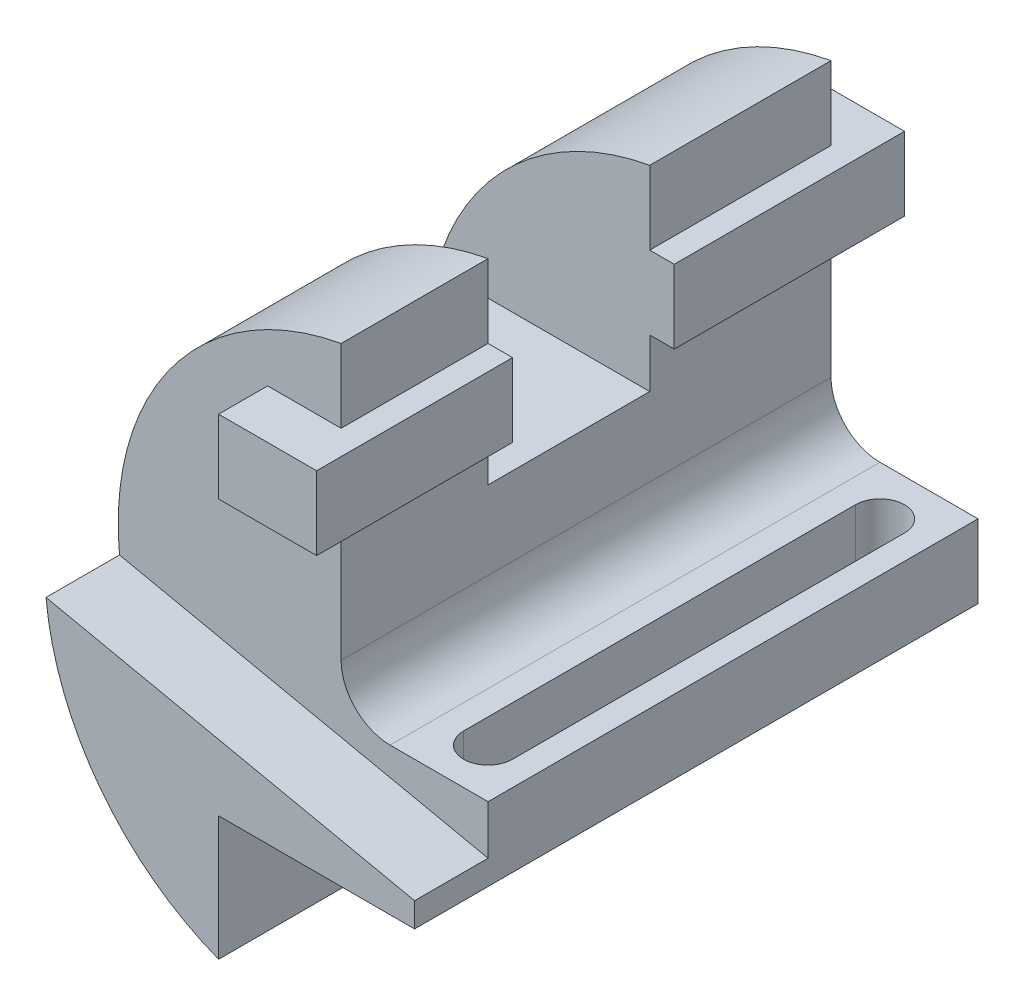
ISO-10303-21;
HEADER;
FILE_DESCRIPTION(('STEP AP214'),'2;1');
FILE_NAME('part.step','',(''),(''),'','','');
FILE_SCHEMA(('AUTOMOTIVE_DESIGN { 1 0 10303 214 1 1 1 1 }'));
ENDSEC;
DATA;
#1=APPLICATION_CONTEXT('core data for automotive mechanical design processes');
#2=APPLICATION_PROTOCOL_DEFINITION('international standard','automotive_design',2000,#1);
#3=PRODUCT_CONTEXT('',#1,'mechanical');
#4=PRODUCT('Part','Part','',(#3));
#5=PRODUCT_RELATED_PRODUCT_CATEGORY('part','',(#4));
#6=PRODUCT_DEFINITION_FORMATION('','',#4);
#7=PRODUCT_DEFINITION_CONTEXT('part definition',#1,'design');
#8=PRODUCT_DEFINITION('design','',#6,#7);
#9=PRODUCT_DEFINITION_SHAPE('','',#8);
#10=(LENGTH_UNIT() NAMED_UNIT(*) SI_UNIT(.MILLI.,.METRE.));
#11=(NAMED_UNIT(*) PLANE_ANGLE_UNIT() SI_UNIT($,.RADIAN.));
#12=(NAMED_UNIT(*) SI_UNIT($,.STERADIAN.) SOLID_ANGLE_UNIT());
#13=UNCERTAINTY_MEASURE_WITH_UNIT(LENGTH_MEASURE(1.E-05),#10,'distance_accuracy_value','');
#14=(GEOMETRIC_REPRESENTATION_CONTEXT(3) GLOBAL_UNCERTAINTY_ASSIGNED_CONTEXT((#13)) GLOBAL_UNIT_ASSIGNED_CONTEXT((#10,
#11,#12)) REPRESENTATION_CONTEXT('',''));
#15=CARTESIAN_POINT('',(0.,0.,0.));
#16=DIRECTION('',(0.,0.,1.));
#17=DIRECTION('',(1.,0.,0.));
#18=AXIS2_PLACEMENT_3D('',#15,#16,#17);
#19=CARTESIAN_POINT('',(0.,0.,100.));
#20=DIRECTION('',(0.,0.,1.));
#21=DIRECTION('',(1.,0.,0.));
#22=AXIS2_PLACEMENT_3D('',#19,#20,#21);
#23=PLANE('',#22);
#24=CARTESIAN_POINT('',(0.,0.,100.));
#25=DIRECTION('',(0.,0.,1.));
#26=DIRECTION('',(1.,0.,0.));
#27=AXIS2_PLACEMENT_3D('',#24,#25,#26);
#28=CIRCLE('',#27,55.5);
#29=CARTESIAN_POINT('',(-10.,54.5916660306315,100.));
#30=VERTEX_POINT('',#29);
#31=CARTESIAN_POINT('',(-55.2350441418964,-5.41663166947499,100.));
#32=VERTEX_POINT('',#31);
#33=EDGE_CURVE('E57',#30,#32,#28,.T.);
#34=ORIENTED_EDGE('',*,*,#33,.T.);
#35=DIRECTION('',(-0.978147600733806,0.207911690817756,0.));
#36=VECTOR('',#35,1.);
#37=CARTESIAN_POINT('',(20.,-21.4083339693686,100.));
#38=LINE('',#37,#36);
#39=CARTESIAN_POINT('',(20.,-21.4083339693686,100.));
#40=VERTEX_POINT('',#39);
#41=EDGE_CURVE('E52',#40,#32,#38,.T.);
#42=ORIENTED_EDGE('',*,*,#41,.F.);
#43=DIRECTION('',(0.,1.,0.));
#44=VECTOR('',#43,1.);
#45=CARTESIAN_POINT('',(20.,-11.4083339693686,100.));
#46=LINE('',#45,#44);
#47=CARTESIAN_POINT('',(20.,-11.4083339693686,100.));
#48=VERTEX_POINT('',#47);
#49=EDGE_CURVE('E244',#40,#48,#46,.T.);
#50=ORIENTED_EDGE('',*,*,#49,.T.);
#51=DIRECTION('',(-1.,0.,0.));
#52=VECTOR('',#51,1.);
#53=CARTESIAN_POINT('',(0.,-11.4083339693686,100.));
#54=LINE('',#53,#52);
#55=CARTESIAN_POINT('',(0.,-11.4083339693686,100.));
#56=VERTEX_POINT('',#55);
#57=EDGE_CURVE('E400',#48,#56,#54,.T.);
#58=ORIENTED_EDGE('',*,*,#57,.T.);
#59=CARTESIAN_POINT('',(0.,-1.40833396936856,100.));
#60=DIRECTION('',(0.,0.,-1.));
#61=DIRECTION('',(-1.,0.,0.));
#62=AXIS2_PLACEMENT_3D('',#59,#60,#61);
#63=CIRCLE('',#62,10.);
#64=CARTESIAN_POINT('',(-10.,-1.40833396936856,100.));
#65=VERTEX_POINT('',#64);
#66=EDGE_CURVE('E402',#56,#65,#63,.T.);
#67=ORIENTED_EDGE('',*,*,#66,.T.);
#68=DIRECTION('',(0.,1.,0.));
#69=VECTOR('',#68,1.);
#70=CARTESIAN_POINT('',(-10.,54.5916660306315,100.));
#71=LINE('',#70,#69);
#72=CARTESIAN_POINT('',(-10.,24.5916660306315,100.));
#73=VERTEX_POINT('',#72);
#74=EDGE_CURVE('E405',#65,#73,#71,.T.);
#75=ORIENTED_EDGE('',*,*,#74,.T.);
#76=DIRECTION('',(1.,0.,0.));
#77=VECTOR('',#76,1.);
#78=CARTESIAN_POINT('',(0.,24.5916660306315,100.));
#79=LINE('',#78,#77);
#80=CARTESIAN_POINT('',(-25.,24.5916660306315,100.));
#81=VERTEX_POINT('',#80);
#82=EDGE_CURVE('E304',#81,#73,#79,.T.);
#83=ORIENTED_EDGE('',*,*,#82,.F.);
#84=DIRECTION('',(0.,-1.,0.));
#85=VECTOR('',#84,1.);
#86=CARTESIAN_POINT('',(-25.,0.,100.));
#87=LINE('',#86,#85);
#88=CARTESIAN_POINT('',(-25.,39.5916660306315,100.));
#89=VERTEX_POINT('',#88);
#90=EDGE_CURVE('E317',#89,#81,#87,.T.);
#91=ORIENTED_EDGE('',*,*,#90,.F.);
#92=DIRECTION('',(-1.,0.,0.));
#93=VECTOR('',#92,1.);
#94=CARTESIAN_POINT('',(0.,39.5916660306315,100.));
#95=LINE('',#94,#93);
#96=CARTESIAN_POINT('',(-10.,39.5916660306315,100.));
#97=VERTEX_POINT('',#96);
#98=EDGE_CURVE('E320',#97,#89,#95,.T.);
#99=ORIENTED_EDGE('',*,*,#98,.F.);
#100=EDGE_CURVE('E404',#97,#30,#71,.T.);
#101=ORIENTED_EDGE('',*,*,#100,.T.);
#102=EDGE_LOOP('',(#34,#42,#50,#58,#67,#75,#83,#91,#99,#101));
#103=FACE_BOUND('',#102,.T.);
#104=ADVANCED_FACE('F37',(#103),#23,.T.);
#105=CARTESIAN_POINT('',(-10.,54.5916660306315,100.));
#106=DIRECTION('',(-1.,0.,0.));
#107=DIRECTION('',(0.,-1.,0.));
#108=AXIS2_PLACEMENT_3D('',#105,#106,#107);
#109=PLANE('',#108);
#110=ORIENTED_EDGE('',*,*,#100,.F.);
#111=DIRECTION('',(0.,0.,-1.));
#112=VECTOR('',#111,1.);
#113=CARTESIAN_POINT('',(-10.,39.5916660306315,100.));
#114=LINE('',#113,#112);
#115=CARTESIAN_POINT('',(-10.,39.5916660306315,70.));
#116=VERTEX_POINT('',#115);
#117=EDGE_CURVE('E323',#97,#116,#114,.T.);
#118=ORIENTED_EDGE('',*,*,#117,.T.);
#119=DIRECTION('',(0.,-1.,0.));
#120=VECTOR('',#119,1.);
#121=CARTESIAN_POINT('',(-10.,54.5916660306315,70.));
#122=LINE('',#121,#120);
#123=CARTESIAN_POINT('',(-10.,54.5916660306315,70.));
#124=VERTEX_POINT('',#123);
#125=EDGE_CURVE('E372',#124,#116,#122,.T.);
#126=ORIENTED_EDGE('',*,*,#125,.F.);
#127=DIRECTION('',(0.,0.,-1.));
#128=VECTOR('',#127,1.);
#129=CARTESIAN_POINT('',(-10.,54.5916660306315,100.));
#130=LINE('',#129,#128);
#131=EDGE_CURVE('E423',#30,#124,#130,.T.);
#132=ORIENTED_EDGE('',*,*,#131,.F.);
#133=EDGE_LOOP('',(#110,#118,#126,#132));
#134=FACE_BOUND('',#133,.T.);
#135=ADVANCED_FACE('F477',(#134),#109,.F.);
#136=DIRECTION('',(0.,1.,0.));
#137=VECTOR('',#136,1.);
#138=CARTESIAN_POINT('',(-10.,54.5916660306315,37.));
#139=LINE('',#138,#137);
#140=CARTESIAN_POINT('',(-10.,39.5916660306315,37.));
#141=VERTEX_POINT('',#140);
#142=CARTESIAN_POINT('',(-10.,54.5916660306315,37.));
#143=VERTEX_POINT('',#142);
#144=EDGE_CURVE('E378',#141,#143,#139,.T.);
#145=ORIENTED_EDGE('',*,*,#144,.F.);
#146=DIRECTION('',(0.,0.,-1.));
#147=VECTOR('',#146,1.);
#148=CARTESIAN_POINT('',(-10.,39.5916660306315,100.));
#149=LINE('',#148,#147);
#150=CARTESIAN_POINT('',(-10.,39.5916660306315,0.));
#151=VERTEX_POINT('',#150);
#152=EDGE_CURVE('E365',#141,#151,#149,.T.);
#153=ORIENTED_EDGE('',*,*,#152,.T.);
#154=DIRECTION('',(0.,1.,0.));
#155=VECTOR('',#154,1.);
#156=CARTESIAN_POINT('',(-10.,54.5916660306315,0.));
#157=LINE('',#156,#155);
#158=CARTESIAN_POINT('',(-10.,54.5916660306315,0.));
#159=VERTEX_POINT('',#158);
#160=EDGE_CURVE('E420',#151,#159,#157,.T.);
#161=ORIENTED_EDGE('',*,*,#160,.T.);
#162=EDGE_CURVE('E407',#143,#159,#130,.T.);
#163=ORIENTED_EDGE('',*,*,#162,.F.);
#164=EDGE_LOOP('',(#145,#153,#161,#163));
#165=FACE_BOUND('',#164,.T.);
#166=ADVANCED_FACE('F489',(#165),#109,.F.);
#167=CARTESIAN_POINT('',(0.,0.,100.));
#168=DIRECTION('',(0.,0.,-1.));
#169=DIRECTION('',(-1.,0.,0.));
#170=AXIS2_PLACEMENT_3D('',#167,#168,#169);
#171=CYLINDRICAL_SURFACE('',#170,55.5);
#172=ORIENTED_EDGE('',*,*,#131,.T.);
#173=CARTESIAN_POINT('',(0.,0.,70.));
#174=DIRECTION('',(0.,0.,1.));
#175=DIRECTION('',(1.,0.,0.));
#176=AXIS2_PLACEMENT_3D('',#173,#174,#175);
#177=CIRCLE('',#176,55.5);
#178=CARTESIAN_POINT('',(-53.5474862383895,14.5916660306314,70.));
#179=VERTEX_POINT('',#178);
#180=EDGE_CURVE('E393',#124,#179,#177,.T.);
#181=ORIENTED_EDGE('',*,*,#180,.T.);
#182=DIRECTION('',(0.,0.,-1.));
#183=VECTOR('',#182,1.);
#184=CARTESIAN_POINT('',(-53.5474862383895,14.5916660306314,100.));
#185=LINE('',#184,#183);
#186=CARTESIAN_POINT('',(-53.5474862383895,14.5916660306314,37.));
#187=VERTEX_POINT('',#186);
#188=EDGE_CURVE('E385',#179,#187,#185,.T.);
#189=ORIENTED_EDGE('',*,*,#188,.T.);
#190=CARTESIAN_POINT('',(0.,0.,37.));
#191=DIRECTION('',(0.,0.,-1.));
#192=DIRECTION('',(0.,1.,0.));
#193=AXIS2_PLACEMENT_3D('',#190,#191,#192);
#194=CIRCLE('',#193,55.5);
#195=EDGE_CURVE('E390',#187,#143,#194,.T.);
#196=ORIENTED_EDGE('',*,*,#195,.T.);
#197=ORIENTED_EDGE('',*,*,#162,.T.);
#198=CARTESIAN_POINT('',(0.,0.,0.));
#199=DIRECTION('',(0.,0.,1.));
#200=DIRECTION('',(1.,0.,0.));
#201=AXIS2_PLACEMENT_3D('',#198,#199,#200);
#202=CIRCLE('',#201,55.5);
#203=CARTESIAN_POINT('',(-20.,-51.7711309515255,0.));
#204=VERTEX_POINT('',#203);
#205=EDGE_CURVE('E396',#159,#204,#202,.T.);
#206=ORIENTED_EDGE('',*,*,#205,.T.);
#207=DIRECTION('',(0.,0.,-1.));
#208=VECTOR('',#207,1.);
#209=CARTESIAN_POINT('',(-20.,-51.7711309515255,100.));
#210=LINE('',#209,#208);
#211=CARTESIAN_POINT('',(-20.,-51.7711309515255,115.));
#212=VERTEX_POINT('',#211);
#213=EDGE_CURVE('E11',#212,#204,#210,.T.);
#214=ORIENTED_EDGE('',*,*,#213,.F.);
#215=CARTESIAN_POINT('',(0.,0.,115.));
#216=DIRECTION('',(0.,0.,1.));
#217=DIRECTION('',(1.,0.,0.));
#218=AXIS2_PLACEMENT_3D('',#215,#216,#217);
#219=CIRCLE('',#218,55.5);
#220=CARTESIAN_POINT('',(-55.2350441418964,-5.41663166947499,115.));
#221=VERTEX_POINT('',#220);
#222=EDGE_CURVE('E230',#221,#212,#219,.T.);
#223=ORIENTED_EDGE('',*,*,#222,.F.);
#224=DIRECTION('',(0.,0.,-1.));
#225=VECTOR('',#224,1.);
#226=CARTESIAN_POINT('',(-55.2350441418964,-5.41663166947499,115.));
#227=LINE('',#226,#225);
#228=EDGE_CURVE('E226',#221,#32,#227,.T.);
#229=ORIENTED_EDGE('',*,*,#228,.T.);
#230=ORIENTED_EDGE('',*,*,#33,.F.);
#231=EDGE_LOOP('',(#172,#181,#189,#196,#197,#206,#214,#223,#229,#230));
#232=FACE_BOUND('',#231,.T.);
#233=ADVANCED_FACE('F39',(#232),#171,.T.);
#234=CARTESIAN_POINT('',(-20.,-26.4083339693686,100.));
#235=DIRECTION('',(-1.,0.,0.));
#236=DIRECTION('',(0.,-1.,0.));
#237=AXIS2_PLACEMENT_3D('',#234,#235,#236);
#238=PLANE('',#237);
#239=DIRECTION('',(0.,1.,0.));
#240=VECTOR('',#239,1.);
#241=CARTESIAN_POINT('',(-20.,-26.4083339693686,0.));
#242=LINE('',#241,#240);
#243=CARTESIAN_POINT('',(-20.,-26.4083339693686,0.));
#244=VERTEX_POINT('',#243);
#245=EDGE_CURVE('E410',#204,#244,#242,.T.);
#246=ORIENTED_EDGE('',*,*,#245,.T.);
#247=DIRECTION('',(0.,0.,-1.));
#248=VECTOR('',#247,1.);
#249=CARTESIAN_POINT('',(-20.,-26.4083339693686,100.));
#250=LINE('',#249,#248);
#251=CARTESIAN_POINT('',(-20.,-26.4083339693686,115.));
#252=VERTEX_POINT('',#251);
#253=EDGE_CURVE('E45',#252,#244,#250,.T.);
#254=ORIENTED_EDGE('',*,*,#253,.F.);
#255=DIRECTION('',(0.,1.,0.));
#256=VECTOR('',#255,1.);
#257=CARTESIAN_POINT('',(-20.,-51.7711309515255,115.));
#258=LINE('',#257,#256);
#259=EDGE_CURVE('E480',#212,#252,#258,.T.);
#260=ORIENTED_EDGE('',*,*,#259,.F.);
#261=ORIENTED_EDGE('',*,*,#213,.T.);
#262=EDGE_LOOP('',(#246,#254,#260,#261));
#263=FACE_BOUND('',#262,.T.);
#264=ADVANCED_FACE('F484',(#263),#238,.F.);
#265=CARTESIAN_POINT('',(20.,-26.4083339693686,100.));
#266=DIRECTION('',(0.,1.,0.));
#267=DIRECTION('',(-1.,0.,0.));
#268=AXIS2_PLACEMENT_3D('',#265,#266,#267);
#269=PLANE('',#268);
#270=DIRECTION('',(0.,0.,1.));
#271=VECTOR('',#270,1.);
#272=CARTESIAN_POINT('',(15.,-26.4083339693686,10.));
#273=LINE('',#272,#271);
#274=CARTESIAN_POINT('',(15.,-26.4083339693686,10.));
#275=VERTEX_POINT('',#274);
#276=CARTESIAN_POINT('',(15.,-26.4083339693686,90.));
#277=VERTEX_POINT('',#276);
#278=EDGE_CURVE('E247',#275,#277,#273,.T.);
#279=ORIENTED_EDGE('',*,*,#278,.F.);
#280=CARTESIAN_POINT('',(10.,-26.4083339693686,10.));
#281=DIRECTION('',(0.,1.,0.));
#282=DIRECTION('',(-1.,0.,0.));
#283=AXIS2_PLACEMENT_3D('',#280,#281,#282);
#284=CIRCLE('',#283,5.);
#285=CARTESIAN_POINT('',(5.,-26.4083339693686,10.));
#286=VERTEX_POINT('',#285);
#287=EDGE_CURVE('E254',#286,#275,#284,.F.);
#288=ORIENTED_EDGE('',*,*,#287,.F.);
#289=DIRECTION('',(0.,0.,-1.));
#290=VECTOR('',#289,1.);
#291=CARTESIAN_POINT('',(5.,-26.4083339693686,10.));
#292=LINE('',#291,#290);
#293=CARTESIAN_POINT('',(5.00000000000001,-26.4083339693686,90.));
#294=VERTEX_POINT('',#293);
#295=EDGE_CURVE('E271',#294,#286,#292,.T.);
#296=ORIENTED_EDGE('',*,*,#295,.F.);
#297=CARTESIAN_POINT('',(10.,-26.4083339693686,90.));
#298=DIRECTION('',(0.,1.,0.));
#299=DIRECTION('',(-1.,0.,0.));
#300=AXIS2_PLACEMENT_3D('',#297,#298,#299);
#301=CIRCLE('',#300,5.);
#302=EDGE_CURVE('E245',#277,#294,#301,.F.);
#303=ORIENTED_EDGE('',*,*,#302,.F.);
#304=EDGE_LOOP('',(#279,#288,#296,#303));
#305=FACE_BOUND('',#304,.T.);
#306=DIRECTION('',(1.,0.,0.));
#307=VECTOR('',#306,1.);
#308=CARTESIAN_POINT('',(20.,-26.4083339693686,0.));
#309=LINE('',#308,#307);
#310=CARTESIAN_POINT('',(20.,-26.4083339693686,0.));
#311=VERTEX_POINT('',#310);
#312=EDGE_CURVE('E412',#244,#311,#309,.T.);
#313=ORIENTED_EDGE('',*,*,#312,.T.);
#314=DIRECTION('',(0.,0.,-1.));
#315=VECTOR('',#314,1.);
#316=CARTESIAN_POINT('',(20.,-26.4083339693686,100.));
#317=LINE('',#316,#315);
#318=CARTESIAN_POINT('',(20.,-26.4083339693686,115.));
#319=VERTEX_POINT('',#318);
#320=EDGE_CURVE('E435',#319,#311,#317,.T.);
#321=ORIENTED_EDGE('',*,*,#320,.F.);
#322=DIRECTION('',(1.,0.,0.));
#323=VECTOR('',#322,1.);
#324=CARTESIAN_POINT('',(-20.,-26.4083339693686,115.));
#325=LINE('',#324,#323);
#326=EDGE_CURVE('E238',#252,#319,#325,.T.);
#327=ORIENTED_EDGE('',*,*,#326,.F.);
#328=ORIENTED_EDGE('',*,*,#253,.T.);
#329=EDGE_LOOP('',(#313,#321,#327,#328));
#330=FACE_BOUND('',#329,.T.);
#331=ADVANCED_FACE('F439',(#305,#330),#269,.F.);
#332=CARTESIAN_POINT('',(20.,-11.4083339693686,100.));
#333=DIRECTION('',(-1.,0.,0.));
#334=DIRECTION('',(0.,0.,1.));
#335=AXIS2_PLACEMENT_3D('',#332,#333,#334);
#336=PLANE('',#335);
#337=DIRECTION('',(0.,1.,0.));
#338=VECTOR('',#337,1.);
#339=CARTESIAN_POINT('',(20.,-11.4083339693686,0.));
#340=LINE('',#339,#338);
#341=CARTESIAN_POINT('',(20.,-11.4083339693686,0.));
#342=VERTEX_POINT('',#341);
#343=EDGE_CURVE('E414',#311,#342,#340,.T.);
#344=ORIENTED_EDGE('',*,*,#343,.T.);
#345=DIRECTION('',(0.,0.,-1.));
#346=VECTOR('',#345,1.);
#347=CARTESIAN_POINT('',(20.,-11.4083339693686,100.));
#348=LINE('',#347,#346);
#349=EDGE_CURVE('E432',#48,#342,#348,.T.);
#350=ORIENTED_EDGE('',*,*,#349,.F.);
#351=ORIENTED_EDGE('',*,*,#49,.F.);
#352=DIRECTION('',(0.,0.,-1.));
#353=VECTOR('',#352,1.);
#354=CARTESIAN_POINT('',(20.,-21.4083339693686,115.));
#355=LINE('',#354,#353);
#356=CARTESIAN_POINT('',(20.,-21.4083339693686,115.));
#357=VERTEX_POINT('',#356);
#358=EDGE_CURVE('E224',#357,#40,#355,.T.);
#359=ORIENTED_EDGE('',*,*,#358,.F.);
#360=DIRECTION('',(0.,1.,0.));
#361=VECTOR('',#360,1.);
#362=CARTESIAN_POINT('',(20.,-21.4083339693686,115.));
#363=LINE('',#362,#361);
#364=EDGE_CURVE('E231',#319,#357,#363,.T.);
#365=ORIENTED_EDGE('',*,*,#364,.F.);
#366=ORIENTED_EDGE('',*,*,#320,.T.);
#367=EDGE_LOOP('',(#344,#350,#351,#359,#365,#366));
#368=FACE_BOUND('',#367,.T.);
#369=ADVANCED_FACE('F242',(#368),#336,.F.);
#370=CARTESIAN_POINT('',(0.,-11.4083339693686,100.));
#371=DIRECTION('',(0.,-1.,0.));
#372=DIRECTION('',(1.,0.,0.));
#373=AXIS2_PLACEMENT_3D('',#370,#371,#372);
#374=PLANE('',#373);
#375=DIRECTION('',(0.,0.,1.));
#376=VECTOR('',#375,1.);
#377=CARTESIAN_POINT('',(5.00000000000001,-11.4083339693686,10.));
#378=LINE('',#377,#376);
#379=CARTESIAN_POINT('',(5.00000000000001,-11.4083339693686,10.));
#380=VERTEX_POINT('',#379);
#381=CARTESIAN_POINT('',(5.00000000000001,-11.4083339693686,90.));
#382=VERTEX_POINT('',#381);
#383=EDGE_CURVE('E259',#380,#382,#378,.T.);
#384=ORIENTED_EDGE('',*,*,#383,.F.);
#385=CARTESIAN_POINT('',(10.,-11.4083339693686,10.));
#386=DIRECTION('',(0.,1.,0.));
#387=DIRECTION('',(-1.,0.,0.));
#388=AXIS2_PLACEMENT_3D('',#385,#386,#387);
#389=CIRCLE('',#388,5.);
#390=CARTESIAN_POINT('',(15.,-11.4083339693686,10.));
#391=VERTEX_POINT('',#390);
#392=EDGE_CURVE('E257',#391,#380,#389,.T.);
#393=ORIENTED_EDGE('',*,*,#392,.F.);
#394=DIRECTION('',(0.,0.,-1.));
#395=VECTOR('',#394,1.);
#396=CARTESIAN_POINT('',(15.,-11.4083339693686,10.));
#397=LINE('',#396,#395);
#398=CARTESIAN_POINT('',(15.,-11.4083339693686,90.));
#399=VERTEX_POINT('',#398);
#400=EDGE_CURVE('E265',#399,#391,#397,.T.);
#401=ORIENTED_EDGE('',*,*,#400,.F.);
#402=CARTESIAN_POINT('',(10.,-11.4083339693686,90.));
#403=DIRECTION('',(0.,1.,0.));
#404=DIRECTION('',(-1.,0.,0.));
#405=AXIS2_PLACEMENT_3D('',#402,#403,#404);
#406=CIRCLE('',#405,5.);
#407=EDGE_CURVE('E262',#382,#399,#406,.T.);
#408=ORIENTED_EDGE('',*,*,#407,.F.);
#409=EDGE_LOOP('',(#384,#393,#401,#408));
#410=FACE_BOUND('',#409,.T.);
#411=DIRECTION('',(-1.,0.,0.));
#412=VECTOR('',#411,1.);
#413=CARTESIAN_POINT('',(0.,-11.4083339693686,0.));
#414=LINE('',#413,#412);
#415=CARTESIAN_POINT('',(0.,-11.4083339693686,0.));
#416=VERTEX_POINT('',#415);
#417=EDGE_CURVE('E416',#342,#416,#414,.T.);
#418=ORIENTED_EDGE('',*,*,#417,.T.);
#419=DIRECTION('',(0.,0.,-1.));
#420=VECTOR('',#419,1.);
#421=CARTESIAN_POINT('',(0.,-11.4083339693686,100.));
#422=LINE('',#421,#420);
#423=EDGE_CURVE('E429',#56,#416,#422,.T.);
#424=ORIENTED_EDGE('',*,*,#423,.F.);
#425=ORIENTED_EDGE('',*,*,#57,.F.);
#426=ORIENTED_EDGE('',*,*,#349,.T.);
#427=EDGE_LOOP('',(#418,#424,#425,#426));
#428=FACE_BOUND('',#427,.T.);
#429=ADVANCED_FACE('F451',(#410,#428),#374,.F.);
#430=CARTESIAN_POINT('',(0.,-1.40833396936856,100.));
#431=DIRECTION('',(0.,0.,-1.));
#432=DIRECTION('',(-1.,0.,0.));
#433=AXIS2_PLACEMENT_3D('',#430,#431,#432);
#434=CYLINDRICAL_SURFACE('',#433,10.);
#435=CARTESIAN_POINT('',(0.,-1.40833396936856,0.));
#436=DIRECTION('',(0.,0.,-1.));
#437=DIRECTION('',(-1.,0.,0.));
#438=AXIS2_PLACEMENT_3D('',#435,#436,#437);
#439=CIRCLE('',#438,10.);
#440=CARTESIAN_POINT('',(-10.,-1.40833396936856,0.));
#441=VERTEX_POINT('',#440);
#442=EDGE_CURVE('E418',#416,#441,#439,.T.);
#443=ORIENTED_EDGE('',*,*,#442,.T.);
#444=DIRECTION('',(0.,0.,-1.));
#445=VECTOR('',#444,1.);
#446=CARTESIAN_POINT('',(-10.,-1.40833396936856,100.));
#447=LINE('',#446,#445);
#448=EDGE_CURVE('E426',#65,#441,#447,.T.);
#449=ORIENTED_EDGE('',*,*,#448,.F.);
#450=ORIENTED_EDGE('',*,*,#66,.F.);
#451=ORIENTED_EDGE('',*,*,#423,.T.);
#452=EDGE_LOOP('',(#443,#449,#450,#451));
#453=FACE_BOUND('',#452,.T.);
#454=ADVANCED_FACE('F457',(#453),#434,.F.);
#455=CARTESIAN_POINT('',(-10.,24.5916660306315,70.));
#456=VERTEX_POINT('',#455);
#457=CARTESIAN_POINT('',(-10.,14.5916660306315,70.));
#458=VERTEX_POINT('',#457);
#459=EDGE_CURVE('E371',#456,#458,#122,.T.);
#460=ORIENTED_EDGE('',*,*,#459,.F.);
#461=DIRECTION('',(0.,0.,1.));
#462=VECTOR('',#461,1.);
#463=CARTESIAN_POINT('',(-10.,24.5916660306315,100.));
#464=LINE('',#463,#462);
#465=EDGE_CURVE('E314',#456,#73,#464,.T.);
#466=ORIENTED_EDGE('',*,*,#465,.T.);
#467=ORIENTED_EDGE('',*,*,#74,.F.);
#468=ORIENTED_EDGE('',*,*,#448,.T.);
#469=CARTESIAN_POINT('',(-10.,24.5916660306315,0.));
#470=VERTEX_POINT('',#469);
#471=EDGE_CURVE('E398',#441,#470,#157,.T.);
#472=ORIENTED_EDGE('',*,*,#471,.T.);
#473=DIRECTION('',(0.,0.,1.));
#474=VECTOR('',#473,1.);
#475=CARTESIAN_POINT('',(-10.,24.5916660306315,100.));
#476=LINE('',#475,#474);
#477=CARTESIAN_POINT('',(-10.,24.5916660306315,37.));
#478=VERTEX_POINT('',#477);
#479=EDGE_CURVE('E359',#470,#478,#476,.T.);
#480=ORIENTED_EDGE('',*,*,#479,.T.);
#481=CARTESIAN_POINT('',(-10.,14.5916660306314,37.));
#482=VERTEX_POINT('',#481);
#483=EDGE_CURVE('E379',#482,#478,#139,.T.);
#484=ORIENTED_EDGE('',*,*,#483,.F.);
#485=DIRECTION('',(0.,0.,-1.));
#486=VECTOR('',#485,1.);
#487=CARTESIAN_POINT('',(-10.,14.5916660306314,70.));
#488=LINE('',#487,#486);
#489=EDGE_CURVE('E375',#458,#482,#488,.T.);
#490=ORIENTED_EDGE('',*,*,#489,.F.);
#491=EDGE_LOOP('',(#460,#466,#467,#468,#472,#480,#484,#490));
#492=FACE_BOUND('',#491,.T.);
#493=ADVANCED_FACE('F460',(#492),#109,.F.);
#494=CARTESIAN_POINT('',(0.,0.,0.));
#495=DIRECTION('',(0.,0.,1.));
#496=DIRECTION('',(1.,0.,0.));
#497=AXIS2_PLACEMENT_3D('',#494,#495,#496);
#498=PLANE('',#497);
#499=ORIENTED_EDGE('',*,*,#160,.F.);
#500=DIRECTION('',(-1.,0.,0.));
#501=VECTOR('',#500,1.);
#502=CARTESIAN_POINT('',(0.,39.5916660306315,0.));
#503=LINE('',#502,#501);
#504=CARTESIAN_POINT('',(-25.,39.5916660306315,0.));
#505=VERTEX_POINT('',#504);
#506=EDGE_CURVE('E362',#151,#505,#503,.T.);
#507=ORIENTED_EDGE('',*,*,#506,.T.);
#508=DIRECTION('',(0.,-1.,0.));
#509=VECTOR('',#508,1.);
#510=CARTESIAN_POINT('',(-25.,0.,0.));
#511=LINE('',#510,#509);
#512=CARTESIAN_POINT('',(-25.,24.5916660306315,0.));
#513=VERTEX_POINT('',#512);
#514=EDGE_CURVE('E368',#505,#513,#511,.T.);
#515=ORIENTED_EDGE('',*,*,#514,.T.);
#516=DIRECTION('',(1.,0.,0.));
#517=VECTOR('',#516,1.);
#518=CARTESIAN_POINT('',(0.,24.5916660306315,0.));
#519=LINE('',#518,#517);
#520=EDGE_CURVE('E349',#513,#470,#519,.T.);
#521=ORIENTED_EDGE('',*,*,#520,.T.);
#522=ORIENTED_EDGE('',*,*,#471,.F.);
#523=ORIENTED_EDGE('',*,*,#442,.F.);
#524=ORIENTED_EDGE('',*,*,#417,.F.);
#525=ORIENTED_EDGE('',*,*,#343,.F.);
#526=ORIENTED_EDGE('',*,*,#312,.F.);
#527=ORIENTED_EDGE('',*,*,#245,.F.);
#528=ORIENTED_EDGE('',*,*,#205,.F.);
#529=EDGE_LOOP('',(#499,#507,#515,#521,#522,#523,#524,#525,#526,#527,#528));
#530=FACE_BOUND('',#529,.T.);
#531=ADVANCED_FACE('F445',(#530),#498,.F.);
#532=CARTESIAN_POINT('',(-55.5,54.5916660306314,70.));
#533=DIRECTION('',(0.,0.,1.));
#534=DIRECTION('',(1.,0.,0.));
#535=AXIS2_PLACEMENT_3D('',#532,#533,#534);
#536=PLANE('',#535);
#537=ORIENTED_EDGE('',*,*,#125,.T.);
#538=DIRECTION('',(1.,0.,0.));
#539=VECTOR('',#538,1.);
#540=CARTESIAN_POINT('',(-5.,39.5916660306315,70.));
#541=LINE('',#540,#539);
#542=CARTESIAN_POINT('',(-5.,39.5916660306315,70.));
#543=VERTEX_POINT('',#542);
#544=EDGE_CURVE('E285',#116,#543,#541,.T.);
#545=ORIENTED_EDGE('',*,*,#544,.T.);
#546=DIRECTION('',(0.,-1.,0.));
#547=VECTOR('',#546,1.);
#548=CARTESIAN_POINT('',(-5.,39.5916660306315,70.));
#549=LINE('',#548,#547);
#550=CARTESIAN_POINT('',(-5.,24.5916660306315,70.));
#551=VERTEX_POINT('',#550);
#552=EDGE_CURVE('E280',#543,#551,#549,.T.);
#553=ORIENTED_EDGE('',*,*,#552,.T.);
#554=DIRECTION('',(-1.,0.,0.));
#555=VECTOR('',#554,1.);
#556=CARTESIAN_POINT('',(-5.,24.5916660306315,70.));
#557=LINE('',#556,#555);
#558=EDGE_CURVE('E297',#551,#456,#557,.T.);
#559=ORIENTED_EDGE('',*,*,#558,.T.);
#560=ORIENTED_EDGE('',*,*,#459,.T.);
#561=DIRECTION('',(1.,0.,0.));
#562=VECTOR('',#561,1.);
#563=CARTESIAN_POINT('',(-55.5,14.5916660306314,70.));
#564=LINE('',#563,#562);
#565=EDGE_CURVE('E382',#179,#458,#564,.T.);
#566=ORIENTED_EDGE('',*,*,#565,.F.);
#567=ORIENTED_EDGE('',*,*,#180,.F.);
#568=EDGE_LOOP('',(#537,#545,#553,#559,#560,#566,#567));
#569=FACE_BOUND('',#568,.T.);
#570=ADVANCED_FACE('F513',(#569),#536,.F.);
#571=CARTESIAN_POINT('',(-55.5,54.5916660306314,37.));
#572=DIRECTION('',(0.,0.,-1.));
#573=DIRECTION('',(0.,1.,0.));
#574=AXIS2_PLACEMENT_3D('',#571,#572,#573);
#575=PLANE('',#574);
#576=ORIENTED_EDGE('',*,*,#483,.T.);
#577=DIRECTION('',(1.,0.,0.));
#578=VECTOR('',#577,1.);
#579=CARTESIAN_POINT('',(-25.,24.5916660306315,37.));
#580=LINE('',#579,#578);
#581=CARTESIAN_POINT('',(-5.,24.5916660306315,37.));
#582=VERTEX_POINT('',#581);
#583=EDGE_CURVE('E325',#478,#582,#580,.T.);
#584=ORIENTED_EDGE('',*,*,#583,.T.);
#585=DIRECTION('',(0.,1.,0.));
#586=VECTOR('',#585,1.);
#587=CARTESIAN_POINT('',(-5.,39.5916660306315,37.));
#588=LINE('',#587,#586);
#589=CARTESIAN_POINT('',(-5.,39.5916660306315,37.));
#590=VERTEX_POINT('',#589);
#591=EDGE_CURVE('E341',#582,#590,#588,.T.);
#592=ORIENTED_EDGE('',*,*,#591,.T.);
#593=DIRECTION('',(-1.,0.,0.));
#594=VECTOR('',#593,1.);
#595=CARTESIAN_POINT('',(-25.,39.5916660306315,37.));
#596=LINE('',#595,#594);
#597=EDGE_CURVE('E330',#590,#141,#596,.T.);
#598=ORIENTED_EDGE('',*,*,#597,.T.);
#599=ORIENTED_EDGE('',*,*,#144,.T.);
#600=ORIENTED_EDGE('',*,*,#195,.F.);
#601=DIRECTION('',(1.,0.,0.));
#602=VECTOR('',#601,1.);
#603=CARTESIAN_POINT('',(-55.5,14.5916660306314,37.));
#604=LINE('',#603,#602);
#605=EDGE_CURVE('E383',#187,#482,#604,.T.);
#606=ORIENTED_EDGE('',*,*,#605,.T.);
#607=EDGE_LOOP('',(#576,#584,#592,#598,#599,#600,#606));
#608=FACE_BOUND('',#607,.T.);
#609=ADVANCED_FACE('F494',(#608),#575,.F.);
#610=CARTESIAN_POINT('',(-55.5,14.5916660306314,70.));
#611=DIRECTION('',(0.,-1.,0.));
#612=DIRECTION('',(1.,0.,0.));
#613=AXIS2_PLACEMENT_3D('',#610,#611,#612);
#614=PLANE('',#613);
#615=ORIENTED_EDGE('',*,*,#565,.T.);
#616=ORIENTED_EDGE('',*,*,#489,.T.);
#617=ORIENTED_EDGE('',*,*,#605,.F.);
#618=ORIENTED_EDGE('',*,*,#188,.F.);
#619=EDGE_LOOP('',(#615,#616,#617,#618));
#620=FACE_BOUND('',#619,.T.);
#621=ADVANCED_FACE('F510',(#620),#614,.F.);
#622=CARTESIAN_POINT('',(-25.,39.5916660306315,-10.));
#623=DIRECTION('',(-1.,0.,0.));
#624=DIRECTION('',(0.,0.,1.));
#625=AXIS2_PLACEMENT_3D('',#622,#623,#624);
#626=PLANE('',#625);
#627=ORIENTED_EDGE('',*,*,#514,.F.);
#628=DIRECTION('',(0.,0.,1.));
#629=VECTOR('',#628,1.);
#630=CARTESIAN_POINT('',(-25.,39.5916660306315,-10.));
#631=LINE('',#630,#629);
#632=CARTESIAN_POINT('',(-25.,39.5916660306315,-10.));
#633=VERTEX_POINT('',#632);
#634=EDGE_CURVE('E346',#633,#505,#631,.T.);
#635=ORIENTED_EDGE('',*,*,#634,.F.);
#636=DIRECTION('',(0.,-1.,0.));
#637=VECTOR('',#636,1.);
#638=CARTESIAN_POINT('',(-25.,39.5916660306315,-10.));
#639=LINE('',#638,#637);
#640=CARTESIAN_POINT('',(-25.,24.5916660306315,-10.));
#641=VERTEX_POINT('',#640);
#642=EDGE_CURVE('E326',#633,#641,#639,.T.);
#643=ORIENTED_EDGE('',*,*,#642,.T.);
#644=DIRECTION('',(0.,0.,1.));
#645=VECTOR('',#644,1.);
#646=CARTESIAN_POINT('',(-25.,24.5916660306315,-10.));
#647=LINE('',#646,#645);
#648=EDGE_CURVE('E339',#641,#513,#647,.T.);
#649=ORIENTED_EDGE('',*,*,#648,.T.);
#650=EDGE_LOOP('',(#627,#635,#643,#649));
#651=FACE_BOUND('',#650,.T.);
#652=ADVANCED_FACE('F505',(#651),#626,.T.);
#653=CARTESIAN_POINT('',(-25.,39.5916660306315,-10.));
#654=DIRECTION('',(0.,1.,0.));
#655=DIRECTION('',(0.,0.,1.));
#656=AXIS2_PLACEMENT_3D('',#653,#654,#655);
#657=PLANE('',#656);
#658=ORIENTED_EDGE('',*,*,#152,.F.);
#659=ORIENTED_EDGE('',*,*,#597,.F.);
#660=DIRECTION('',(0.,0.,1.));
#661=VECTOR('',#660,1.);
#662=CARTESIAN_POINT('',(-5.,39.5916660306315,-10.));
#663=LINE('',#662,#661);
#664=CARTESIAN_POINT('',(-5.,39.5916660306315,-10.));
#665=VERTEX_POINT('',#664);
#666=EDGE_CURVE('E350',#665,#590,#663,.T.);
#667=ORIENTED_EDGE('',*,*,#666,.F.);
#668=DIRECTION('',(-1.,0.,0.));
#669=VECTOR('',#668,1.);
#670=CARTESIAN_POINT('',(-25.,39.5916660306315,-10.));
#671=LINE('',#670,#669);
#672=EDGE_CURVE('E336',#665,#633,#671,.T.);
#673=ORIENTED_EDGE('',*,*,#672,.T.);
#674=ORIENTED_EDGE('',*,*,#634,.T.);
#675=ORIENTED_EDGE('',*,*,#506,.F.);
#676=EDGE_LOOP('',(#658,#659,#667,#673,#674,#675));
#677=FACE_BOUND('',#676,.T.);
#678=ADVANCED_FACE('F492',(#677),#657,.T.);
#679=CARTESIAN_POINT('',(-25.,24.5916660306315,-10.));
#680=DIRECTION('',(0.,-1.,0.));
#681=DIRECTION('',(0.,0.,-1.));
#682=AXIS2_PLACEMENT_3D('',#679,#680,#681);
#683=PLANE('',#682);
#684=ORIENTED_EDGE('',*,*,#479,.F.);
#685=ORIENTED_EDGE('',*,*,#520,.F.);
#686=ORIENTED_EDGE('',*,*,#648,.F.);
#687=DIRECTION('',(1.,0.,0.));
#688=VECTOR('',#687,1.);
#689=CARTESIAN_POINT('',(-25.,24.5916660306315,-10.));
#690=LINE('',#689,#688);
#691=CARTESIAN_POINT('',(-5.,24.5916660306315,-10.));
#692=VERTEX_POINT('',#691);
#693=EDGE_CURVE('E329',#641,#692,#690,.T.);
#694=ORIENTED_EDGE('',*,*,#693,.T.);
#695=DIRECTION('',(0.,0.,1.));
#696=VECTOR('',#695,1.);
#697=CARTESIAN_POINT('',(-5.,24.5916660306315,-10.));
#698=LINE('',#697,#696);
#699=EDGE_CURVE('E352',#692,#582,#698,.T.);
#700=ORIENTED_EDGE('',*,*,#699,.T.);
#701=ORIENTED_EDGE('',*,*,#583,.F.);
#702=EDGE_LOOP('',(#684,#685,#686,#694,#700,#701));
#703=FACE_BOUND('',#702,.T.);
#704=ADVANCED_FACE('F755',(#703),#683,.T.);
#705=CARTESIAN_POINT('',(-5.,39.5916660306315,-10.));
#706=DIRECTION('',(1.,0.,0.));
#707=DIRECTION('',(0.,1.,0.));
#708=AXIS2_PLACEMENT_3D('',#705,#706,#707);
#709=PLANE('',#708);
#710=ORIENTED_EDGE('',*,*,#591,.F.);
#711=ORIENTED_EDGE('',*,*,#699,.F.);
#712=DIRECTION('',(0.,1.,0.));
#713=VECTOR('',#712,1.);
#714=CARTESIAN_POINT('',(-5.,39.5916660306315,-10.));
#715=LINE('',#714,#713);
#716=EDGE_CURVE('E333',#692,#665,#715,.T.);
#717=ORIENTED_EDGE('',*,*,#716,.T.);
#718=ORIENTED_EDGE('',*,*,#666,.T.);
#719=EDGE_LOOP('',(#710,#711,#717,#718));
#720=FACE_BOUND('',#719,.T.);
#721=ADVANCED_FACE('F497',(#720),#709,.T.);
#722=CARTESIAN_POINT('',(0.,0.,-10.));
#723=DIRECTION('',(0.,0.,1.));
#724=DIRECTION('',(1.,0.,0.));
#725=AXIS2_PLACEMENT_3D('',#722,#723,#724);
#726=PLANE('',#725);
#727=ORIENTED_EDGE('',*,*,#642,.F.);
#728=ORIENTED_EDGE('',*,*,#672,.F.);
#729=ORIENTED_EDGE('',*,*,#716,.F.);
#730=ORIENTED_EDGE('',*,*,#693,.F.);
#731=EDGE_LOOP('',(#727,#728,#729,#730));
#732=FACE_BOUND('',#731,.T.);
#733=ADVANCED_FACE('F502',(#732),#726,.F.);
#734=CARTESIAN_POINT('',(-5.,39.5916660306315,110.));
#735=DIRECTION('',(0.,1.,0.));
#736=DIRECTION('',(0.,0.,1.));
#737=AXIS2_PLACEMENT_3D('',#734,#735,#736);
#738=PLANE('',#737);
#739=ORIENTED_EDGE('',*,*,#117,.F.);
#740=ORIENTED_EDGE('',*,*,#98,.T.);
#741=DIRECTION('',(0.,0.,-1.));
#742=VECTOR('',#741,1.);
#743=CARTESIAN_POINT('',(-25.,39.5916660306315,110.));
#744=LINE('',#743,#742);
#745=CARTESIAN_POINT('',(-25.,39.5916660306315,110.));
#746=VERTEX_POINT('',#745);
#747=EDGE_CURVE('E305',#746,#89,#744,.T.);
#748=ORIENTED_EDGE('',*,*,#747,.F.);
#749=DIRECTION('',(1.,0.,0.));
#750=VECTOR('',#749,1.);
#751=CARTESIAN_POINT('',(-5.,39.5916660306315,110.));
#752=LINE('',#751,#750);
#753=CARTESIAN_POINT('',(-5.,39.5916660306315,110.));
#754=VERTEX_POINT('',#753);
#755=EDGE_CURVE('E291',#746,#754,#752,.T.);
#756=ORIENTED_EDGE('',*,*,#755,.T.);
#757=DIRECTION('',(0.,0.,-1.));
#758=VECTOR('',#757,1.);
#759=CARTESIAN_POINT('',(-5.,39.5916660306315,110.));
#760=LINE('',#759,#758);
#761=EDGE_CURVE('E301',#754,#543,#760,.T.);
#762=ORIENTED_EDGE('',*,*,#761,.T.);
#763=ORIENTED_EDGE('',*,*,#544,.F.);
#764=EDGE_LOOP('',(#739,#740,#748,#756,#762,#763));
#765=FACE_BOUND('',#764,.T.);
#766=ADVANCED_FACE('F472',(#765),#738,.T.);
#767=CARTESIAN_POINT('',(-5.,24.5916660306315,110.));
#768=DIRECTION('',(0.,-1.,0.));
#769=DIRECTION('',(0.,0.,-1.));
#770=AXIS2_PLACEMENT_3D('',#767,#768,#769);
#771=PLANE('',#770);
#772=ORIENTED_EDGE('',*,*,#465,.F.);
#773=ORIENTED_EDGE('',*,*,#558,.F.);
#774=DIRECTION('',(0.,0.,-1.));
#775=VECTOR('',#774,1.);
#776=CARTESIAN_POINT('',(-5.,24.5916660306315,110.));
#777=LINE('',#776,#775);
#778=CARTESIAN_POINT('',(-5.,24.5916660306315,110.));
#779=VERTEX_POINT('',#778);
#780=EDGE_CURVE('E294',#779,#551,#777,.T.);
#781=ORIENTED_EDGE('',*,*,#780,.F.);
#782=DIRECTION('',(-1.,0.,0.));
#783=VECTOR('',#782,1.);
#784=CARTESIAN_POINT('',(-5.,24.5916660306315,110.));
#785=LINE('',#784,#783);
#786=CARTESIAN_POINT('',(-25.,24.5916660306315,110.));
#787=VERTEX_POINT('',#786);
#788=EDGE_CURVE('E284',#779,#787,#785,.T.);
#789=ORIENTED_EDGE('',*,*,#788,.T.);
#790=DIRECTION('',(0.,0.,-1.));
#791=VECTOR('',#790,1.);
#792=CARTESIAN_POINT('',(-25.,24.5916660306315,110.));
#793=LINE('',#792,#791);
#794=EDGE_CURVE('E308',#787,#81,#793,.T.);
#795=ORIENTED_EDGE('',*,*,#794,.T.);
#796=ORIENTED_EDGE('',*,*,#82,.T.);
#797=EDGE_LOOP('',(#772,#773,#781,#789,#795,#796));
#798=FACE_BOUND('',#797,.T.);
#799=ADVANCED_FACE('F465',(#798),#771,.T.);
#800=CARTESIAN_POINT('',(-5.,39.5916660306315,110.));
#801=DIRECTION('',(1.,0.,0.));
#802=DIRECTION('',(0.,0.,-1.));
#803=AXIS2_PLACEMENT_3D('',#800,#801,#802);
#804=PLANE('',#803);
#805=ORIENTED_EDGE('',*,*,#552,.F.);
#806=ORIENTED_EDGE('',*,*,#761,.F.);
#807=DIRECTION('',(0.,-1.,0.));
#808=VECTOR('',#807,1.);
#809=CARTESIAN_POINT('',(-5.,39.5916660306315,110.));
#810=LINE('',#809,#808);
#811=EDGE_CURVE('E281',#754,#779,#810,.T.);
#812=ORIENTED_EDGE('',*,*,#811,.T.);
#813=ORIENTED_EDGE('',*,*,#780,.T.);
#814=EDGE_LOOP('',(#805,#806,#812,#813));
#815=FACE_BOUND('',#814,.T.);
#816=ADVANCED_FACE('F520',(#815),#804,.T.);
#817=CARTESIAN_POINT('',(-25.,39.5916660306315,110.));
#818=DIRECTION('',(-1.,0.,0.));
#819=DIRECTION('',(0.,0.,1.));
#820=AXIS2_PLACEMENT_3D('',#817,#818,#819);
#821=PLANE('',#820);
#822=ORIENTED_EDGE('',*,*,#747,.T.);
#823=ORIENTED_EDGE('',*,*,#90,.T.);
#824=ORIENTED_EDGE('',*,*,#794,.F.);
#825=DIRECTION('',(0.,1.,0.));
#826=VECTOR('',#825,1.);
#827=CARTESIAN_POINT('',(-25.,39.5916660306315,110.));
#828=LINE('',#827,#826);
#829=EDGE_CURVE('E288',#787,#746,#828,.T.);
#830=ORIENTED_EDGE('',*,*,#829,.T.);
#831=EDGE_LOOP('',(#822,#823,#824,#830));
#832=FACE_BOUND('',#831,.T.);
#833=ADVANCED_FACE('F467',(#832),#821,.T.);
#834=CARTESIAN_POINT('',(0.,0.,110.));
#835=DIRECTION('',(0.,0.,-1.));
#836=DIRECTION('',(-1.,0.,0.));
#837=AXIS2_PLACEMENT_3D('',#834,#835,#836);
#838=PLANE('',#837);
#839=ORIENTED_EDGE('',*,*,#811,.F.);
#840=ORIENTED_EDGE('',*,*,#755,.F.);
#841=ORIENTED_EDGE('',*,*,#829,.F.);
#842=ORIENTED_EDGE('',*,*,#788,.F.);
#843=EDGE_LOOP('',(#839,#840,#841,#842));
#844=FACE_BOUND('',#843,.T.);
#845=ADVANCED_FACE('F519',(#844),#838,.F.);
#846=CARTESIAN_POINT('',(10.,-51.7721309515255,10.));
#847=DIRECTION('',(0.,1.,0.));
#848=DIRECTION('',(-1.,0.,0.));
#849=AXIS2_PLACEMENT_3D('',#846,#847,#848);
#850=CYLINDRICAL_SURFACE('',#849,5.);
#851=ORIENTED_EDGE('',*,*,#287,.T.);
#852=DIRECTION('',(0.,1.,0.));
#853=VECTOR('',#852,1.);
#854=CARTESIAN_POINT('',(15.,-51.7721309515255,10.));
#855=LINE('',#854,#853);
#856=EDGE_CURVE('E269',#275,#391,#855,.T.);
#857=ORIENTED_EDGE('',*,*,#856,.T.);
#858=ORIENTED_EDGE('',*,*,#392,.T.);
#859=DIRECTION('',(0.,1.,0.));
#860=VECTOR('',#859,1.);
#861=CARTESIAN_POINT('',(5.,-51.7721309515255,10.));
#862=LINE('',#861,#860);
#863=EDGE_CURVE('E268',#286,#380,#862,.T.);
#864=ORIENTED_EDGE('',*,*,#863,.F.);
#865=EDGE_LOOP('',(#851,#857,#858,#864));
#866=FACE_BOUND('',#865,.T.);
#867=ADVANCED_FACE('F621',(#866),#850,.F.);
#868=CARTESIAN_POINT('',(15.,-51.7721309515255,10.));
#869=DIRECTION('',(1.,0.,0.));
#870=DIRECTION('',(0.,0.,-1.));
#871=AXIS2_PLACEMENT_3D('',#868,#869,#870);
#872=PLANE('',#871);
#873=ORIENTED_EDGE('',*,*,#278,.T.);
#874=DIRECTION('',(0.,1.,0.));
#875=VECTOR('',#874,1.);
#876=CARTESIAN_POINT('',(15.,-51.7721309515255,90.));
#877=LINE('',#876,#875);
#878=EDGE_CURVE('E272',#277,#399,#877,.T.);
#879=ORIENTED_EDGE('',*,*,#878,.T.);
#880=ORIENTED_EDGE('',*,*,#400,.T.);
#881=ORIENTED_EDGE('',*,*,#856,.F.);
#882=EDGE_LOOP('',(#873,#879,#880,#881));
#883=FACE_BOUND('',#882,.T.);
#884=ADVANCED_FACE('F637',(#883),#872,.F.);
#885=CARTESIAN_POINT('',(10.,-51.7721309515255,90.));
#886=DIRECTION('',(0.,1.,0.));
#887=DIRECTION('',(-1.,0.,0.));
#888=AXIS2_PLACEMENT_3D('',#885,#886,#887);
#889=CYLINDRICAL_SURFACE('',#888,5.);
#890=ORIENTED_EDGE('',*,*,#302,.T.);
#891=DIRECTION('',(0.,1.,0.));
#892=VECTOR('',#891,1.);
#893=CARTESIAN_POINT('',(5.00000000000001,-51.7721309515255,90.));
#894=LINE('',#893,#892);
#895=EDGE_CURVE('E274',#294,#382,#894,.T.);
#896=ORIENTED_EDGE('',*,*,#895,.T.);
#897=ORIENTED_EDGE('',*,*,#407,.T.);
#898=ORIENTED_EDGE('',*,*,#878,.F.);
#899=EDGE_LOOP('',(#890,#896,#897,#898));
#900=FACE_BOUND('',#899,.T.);
#901=ADVANCED_FACE('F647',(#900),#889,.F.);
#902=CARTESIAN_POINT('',(5.,-51.7721309515255,10.));
#903=DIRECTION('',(-1.,0.,0.));
#904=DIRECTION('',(0.,0.,1.));
#905=AXIS2_PLACEMENT_3D('',#902,#903,#904);
#906=PLANE('',#905);
#907=ORIENTED_EDGE('',*,*,#295,.T.);
#908=ORIENTED_EDGE('',*,*,#863,.T.);
#909=ORIENTED_EDGE('',*,*,#383,.T.);
#910=ORIENTED_EDGE('',*,*,#895,.F.);
#911=EDGE_LOOP('',(#907,#908,#909,#910));
#912=FACE_BOUND('',#911,.T.);
#913=ADVANCED_FACE('F657',(#912),#906,.F.);
#914=CARTESIAN_POINT('',(20.,-21.4083339693686,115.));
#915=DIRECTION('',(-0.207911690817756,-0.978147600733806,0.));
#916=DIRECTION('',(0.978147600733806,-0.207911690817756,0.));
#917=AXIS2_PLACEMENT_3D('',#914,#915,#916);
#918=PLANE('',#917);
#919=ORIENTED_EDGE('',*,*,#41,.T.);
#920=ORIENTED_EDGE('',*,*,#228,.F.);
#921=DIRECTION('',(-0.978147600733806,0.207911690817756,0.));
#922=VECTOR('',#921,1.);
#923=CARTESIAN_POINT('',(20.,-21.4083339693686,115.));
#924=LINE('',#923,#922);
#925=EDGE_CURVE('E220',#357,#221,#924,.T.);
#926=ORIENTED_EDGE('',*,*,#925,.F.);
#927=ORIENTED_EDGE('',*,*,#358,.T.);
#928=EDGE_LOOP('',(#919,#920,#926,#927));
#929=FACE_BOUND('',#928,.T.);
#930=ADVANCED_FACE('F222',(#929),#918,.F.);
#931=CARTESIAN_POINT('',(0.,0.,115.));
#932=DIRECTION('',(0.,0.,1.));
#933=DIRECTION('',(1.,0.,0.));
#934=AXIS2_PLACEMENT_3D('',#931,#932,#933);
#935=PLANE('',#934);
#936=ORIENTED_EDGE('',*,*,#364,.T.);
#937=ORIENTED_EDGE('',*,*,#925,.T.);
#938=ORIENTED_EDGE('',*,*,#222,.T.);
#939=ORIENTED_EDGE('',*,*,#259,.T.);
#940=ORIENTED_EDGE('',*,*,#326,.T.);
#941=EDGE_LOOP('',(#936,#937,#938,#939,#940));
#942=FACE_BOUND('',#941,.T.);
#943=ADVANCED_FACE('F235',(#942),#935,.T.);
#944=CLOSED_SHELL('',(#104,#135,#166,#233,#264,#331,#369,#429,#454,#493,#531,#570,#609,#621,
#652,#678,#704,#721,#733,#766,#799,#816,#833,#845,#867,#884,#901,#913,#930,#943));
#945=MANIFOLD_SOLID_BREP('B2',#944);
#946=ADVANCED_BREP_SHAPE_REPRESENTATION('',(#18,#945),#14);
#947=SHAPE_DEFINITION_REPRESENTATION(#9,#946);
ENDSEC;
END-ISO-10303-21;
